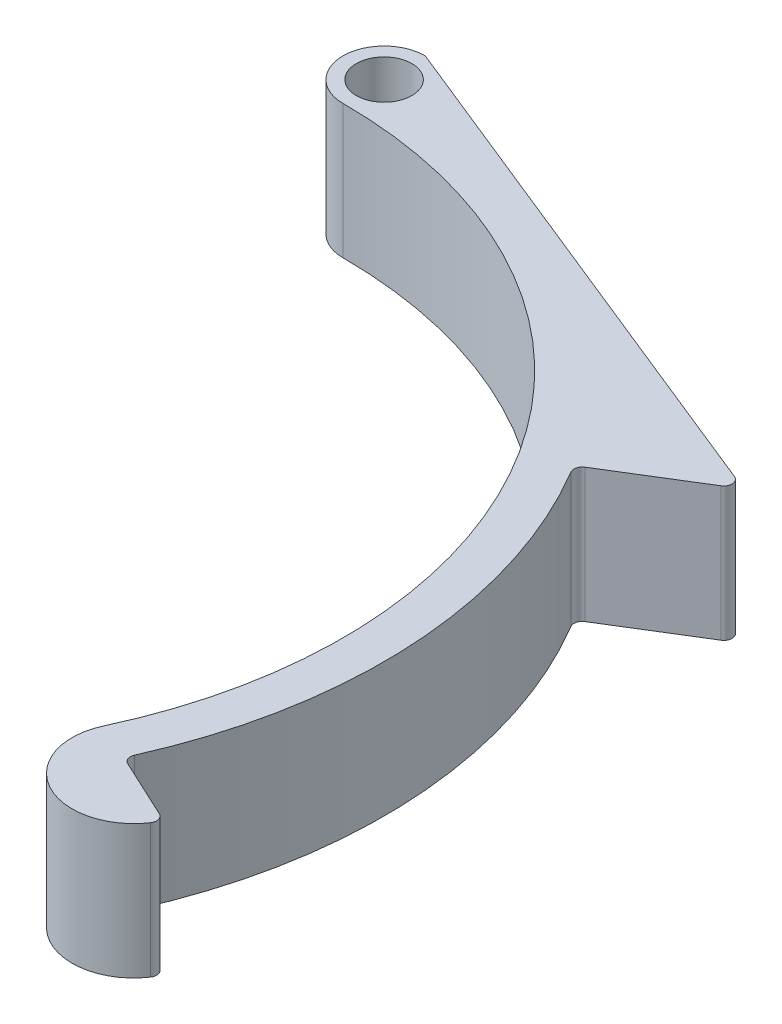
ISO-10303-21;
HEADER;
FILE_DESCRIPTION(('STEP AP214'),'2;1');
FILE_NAME('part.step','',(''),(''),'','','');
FILE_SCHEMA(('AUTOMOTIVE_DESIGN { 1 0 10303 214 1 1 1 1 }'));
ENDSEC;
DATA;
#1=APPLICATION_CONTEXT('core data for automotive mechanical design processes');
#2=APPLICATION_PROTOCOL_DEFINITION('international standard','automotive_design',2000,#1);
#3=PRODUCT_CONTEXT('',#1,'mechanical');
#4=PRODUCT('Part','Part','',(#3));
#5=PRODUCT_RELATED_PRODUCT_CATEGORY('part','',(#4));
#6=PRODUCT_DEFINITION_FORMATION('','',#4);
#7=PRODUCT_DEFINITION_CONTEXT('part definition',#1,'design');
#8=PRODUCT_DEFINITION('design','',#6,#7);
#9=PRODUCT_DEFINITION_SHAPE('','',#8);
#10=(LENGTH_UNIT() NAMED_UNIT(*) SI_UNIT(.MILLI.,.METRE.));
#11=(NAMED_UNIT(*) PLANE_ANGLE_UNIT() SI_UNIT($,.RADIAN.));
#12=(NAMED_UNIT(*) SI_UNIT($,.STERADIAN.) SOLID_ANGLE_UNIT());
#13=UNCERTAINTY_MEASURE_WITH_UNIT(LENGTH_MEASURE(1.E-05),#10,'distance_accuracy_value','');
#14=(GEOMETRIC_REPRESENTATION_CONTEXT(3) GLOBAL_UNCERTAINTY_ASSIGNED_CONTEXT((#13)) GLOBAL_UNIT_ASSIGNED_CONTEXT((#10,
#11,#12)) REPRESENTATION_CONTEXT('',''));
#15=CARTESIAN_POINT('',(0.,0.,0.));
#16=DIRECTION('',(0.,0.,1.));
#17=DIRECTION('',(1.,0.,0.));
#18=AXIS2_PLACEMENT_3D('',#15,#16,#17);
#19=CARTESIAN_POINT('',(0.,13.,0.));
#20=DIRECTION('',(0.,-1.,0.));
#21=DIRECTION('',(0.,0.,-1.));
#22=AXIS2_PLACEMENT_3D('',#19,#20,#21);
#23=CYLINDRICAL_SURFACE('',#22,45.);
#24=CARTESIAN_POINT('',(0.,0.,0.));
#25=DIRECTION('',(0.,1.,0.));
#26=DIRECTION('',(0.,0.,1.));
#27=AXIS2_PLACEMENT_3D('',#24,#25,#26);
#28=CIRCLE('',#27,45.);
#29=CARTESIAN_POINT('',(0.,0.,-45.));
#30=VERTEX_POINT('',#29);
#31=CARTESIAN_POINT('',(40.7838504166493,0.,19.0178217783314));
#32=VERTEX_POINT('',#31);
#33=EDGE_CURVE('E158',#30,#32,#28,.F.);
#34=ORIENTED_EDGE('',*,*,#33,.T.);
#35=DIRECTION('',(0.,-1.,0.));
#36=VECTOR('',#35,1.);
#37=CARTESIAN_POINT('',(40.7838504166493,13.,19.0178217783314));
#38=LINE('',#37,#36);
#39=CARTESIAN_POINT('',(40.7838504166493,13.,19.0178217783314));
#40=VERTEX_POINT('',#39);
#41=EDGE_CURVE('E141',#40,#32,#38,.T.);
#42=ORIENTED_EDGE('',*,*,#41,.F.);
#43=CARTESIAN_POINT('',(0.,13.,0.));
#44=DIRECTION('',(0.,1.,0.));
#45=DIRECTION('',(0.,0.,1.));
#46=AXIS2_PLACEMENT_3D('',#43,#44,#45);
#47=CIRCLE('',#46,45.);
#48=CARTESIAN_POINT('',(0.,13.,-45.));
#49=VERTEX_POINT('',#48);
#50=EDGE_CURVE('E148',#49,#40,#47,.F.);
#51=ORIENTED_EDGE('',*,*,#50,.F.);
#52=DIRECTION('',(0.,-1.,0.));
#53=VECTOR('',#52,1.);
#54=CARTESIAN_POINT('',(0.,13.,-45.));
#55=LINE('',#54,#53);
#56=EDGE_CURVE('E161',#49,#30,#55,.T.);
#57=ORIENTED_EDGE('',*,*,#56,.T.);
#58=EDGE_LOOP('',(#34,#42,#51,#57));
#59=FACE_BOUND('',#58,.T.);
#60=ADVANCED_FACE('F45',(#59),#23,.F.);
#61=CARTESIAN_POINT('',(46.2216971388692,13.,21.5535313487756));
#62=DIRECTION('',(0.,-1.,0.));
#63=DIRECTION('',(0.,0.,-1.));
#64=AXIS2_PLACEMENT_3D('',#61,#62,#63);
#65=CYLINDRICAL_SURFACE('',#64,6.);
#66=CARTESIAN_POINT('',(46.2216971388692,0.,21.5535313487756));
#67=DIRECTION('',(0.,1.,0.));
#68=DIRECTION('',(0.,0.,1.));
#69=AXIS2_PLACEMENT_3D('',#66,#67,#68);
#70=CIRCLE('',#69,6.);
#71=CARTESIAN_POINT('',(51.2046961183429,0.,24.8956446279096));
#72=VERTEX_POINT('',#71);
#73=EDGE_CURVE('E266',#32,#72,#70,.T.);
#74=ORIENTED_EDGE('',*,*,#73,.T.);
#75=DIRECTION('',(0.,-1.,0.));
#76=VECTOR('',#75,1.);
#77=CARTESIAN_POINT('',(51.2046961183429,13.,24.8956446279096));
#78=LINE('',#77,#76);
#79=CARTESIAN_POINT('',(51.2046961183429,13.,24.8956446279096));
#80=VERTEX_POINT('',#79);
#81=EDGE_CURVE('E144',#72,#80,#78,.F.);
#82=ORIENTED_EDGE('',*,*,#81,.T.);
#83=CARTESIAN_POINT('',(46.2216971388692,13.,21.5535313487756));
#84=DIRECTION('',(0.,1.,0.));
#85=DIRECTION('',(0.,0.,1.));
#86=AXIS2_PLACEMENT_3D('',#83,#84,#85);
#87=CIRCLE('',#86,6.);
#88=EDGE_CURVE('E136',#40,#80,#87,.T.);
#89=ORIENTED_EDGE('',*,*,#88,.F.);
#90=ORIENTED_EDGE('',*,*,#41,.T.);
#91=EDGE_LOOP('',(#74,#82,#89,#90));
#92=FACE_BOUND('',#91,.T.);
#93=ADVANCED_FACE('F139',(#92),#65,.T.);
#94=CARTESIAN_POINT('',(0.,13.,0.));
#95=DIRECTION('',(-0.422618261740697,0.,0.906307787036651));
#96=DIRECTION('',(0.906307787036651,0.,0.422618261740697));
#97=AXIS2_PLACEMENT_3D('',#94,#95,#96);
#98=PLANE('',#97);
#99=DIRECTION('',(-0.906307787036651,0.,-0.422618261740697));
#100=VECTOR('',#99,1.);
#101=CARTESIAN_POINT('',(0.,13.,0.));
#102=LINE('',#101,#100);
#103=CARTESIAN_POINT('',(50.8783908638056,13.,23.7249832943957));
#104=VERTEX_POINT('',#103);
#105=CARTESIAN_POINT('',(45.1283037541675,13.,21.0436736401131));
#106=VERTEX_POINT('',#105);
#107=EDGE_CURVE('E147',#104,#106,#102,.T.);
#108=ORIENTED_EDGE('',*,*,#107,.F.);
#109=DIRECTION('',(0.,-1.,0.));
#110=VECTOR('',#109,1.);
#111=CARTESIAN_POINT('',(50.8783908638056,13.,23.7249832943957));
#112=LINE('',#111,#110);
#113=CARTESIAN_POINT('',(50.8783908638056,0.,23.7249832943957));
#114=VERTEX_POINT('',#113);
#115=EDGE_CURVE('E165',#104,#114,#112,.T.);
#116=ORIENTED_EDGE('',*,*,#115,.T.);
#117=DIRECTION('',(-0.906307787036651,0.,-0.422618261740697));
#118=VECTOR('',#117,1.);
#119=CARTESIAN_POINT('',(0.,0.,0.));
#120=LINE('',#119,#118);
#121=CARTESIAN_POINT('',(45.1283037541675,0.,21.0436736401131));
#122=VERTEX_POINT('',#121);
#123=EDGE_CURVE('E240',#114,#122,#120,.T.);
#124=ORIENTED_EDGE('',*,*,#123,.T.);
#125=DIRECTION('',(0.,1.,0.));
#126=VECTOR('',#125,1.);
#127=CARTESIAN_POINT('',(45.1283037541675,13.,21.0436736401131));
#128=LINE('',#127,#126);
#129=EDGE_CURVE('E160',#122,#106,#128,.T.);
#130=ORIENTED_EDGE('',*,*,#129,.T.);
#131=EDGE_LOOP('',(#108,#116,#124,#130));
#132=FACE_BOUND('',#131,.T.);
#133=ADVANCED_FACE('F295',(#132),#98,.F.);
#134=CARTESIAN_POINT('',(0.,13.,0.));
#135=DIRECTION('',(0.,-1.,0.));
#136=DIRECTION('',(0.,0.,-1.));
#137=AXIS2_PLACEMENT_3D('',#134,#135,#136);
#138=CYLINDRICAL_SURFACE('',#137,49.);
#139=CARTESIAN_POINT('',(0.,13.,0.));
#140=DIRECTION('',(0.,1.,0.));
#141=DIRECTION('',(0.,0.,1.));
#142=AXIS2_PLACEMENT_3D('',#139,#140,#141);
#143=CIRCLE('',#142,49.);
#144=CARTESIAN_POINT('',(44.7360144541053,13.,19.9922237573033));
#145=VERTEX_POINT('',#144);
#146=CARTESIAN_POINT('',(42.1148392112088,13.,-25.0467626294103));
#147=VERTEX_POINT('',#146);
#148=EDGE_CURVE('E245',#145,#147,#143,.T.);
#149=ORIENTED_EDGE('',*,*,#148,.F.);
#150=DIRECTION('',(0.,-1.,0.));
#151=VECTOR('',#150,1.);
#152=CARTESIAN_POINT('',(44.7360144541052,13.,19.9922237573033));
#153=LINE('',#152,#151);
#154=CARTESIAN_POINT('',(44.7360144541053,0.,19.9922237573033));
#155=VERTEX_POINT('',#154);
#156=EDGE_CURVE('E194',#145,#155,#153,.T.);
#157=ORIENTED_EDGE('',*,*,#156,.T.);
#158=CARTESIAN_POINT('',(0.,0.,0.));
#159=DIRECTION('',(0.,1.,0.));
#160=DIRECTION('',(0.,0.,1.));
#161=AXIS2_PLACEMENT_3D('',#158,#159,#160);
#162=CIRCLE('',#161,49.);
#163=CARTESIAN_POINT('',(42.1148392112088,0.,-25.0467626294103));
#164=VERTEX_POINT('',#163);
#165=EDGE_CURVE('E228',#155,#164,#162,.T.);
#166=ORIENTED_EDGE('',*,*,#165,.T.);
#167=DIRECTION('',(0.,-1.,0.));
#168=VECTOR('',#167,1.);
#169=CARTESIAN_POINT('',(42.1148392112088,13.,-25.0467626294103));
#170=LINE('',#169,#168);
#171=EDGE_CURVE('E191',#164,#147,#170,.F.);
#172=ORIENTED_EDGE('',*,*,#171,.T.);
#173=EDGE_LOOP('',(#149,#157,#166,#172));
#174=FACE_BOUND('',#173,.T.);
#175=ADVANCED_FACE('F236',(#174),#138,.T.);
#176=CARTESIAN_POINT('',(0.,13.,0.));
#177=DIRECTION('',(0.524899474172595,0.,0.851164227404637));
#178=DIRECTION('',(0.851164227404637,0.,-0.524899474172595));
#179=AXIS2_PLACEMENT_3D('',#176,#177,#178);
#180=PLANE('',#179);
#181=DIRECTION('',(-0.851164227404637,0.,0.524899474172595));
#182=VECTOR('',#181,1.);
#183=CARTESIAN_POINT('',(0.,0.,0.));
#184=LINE('',#183,#182);
#185=CARTESIAN_POINT('',(50.5748997151719,0.,-31.1887382153871));
#186=VERTEX_POINT('',#185);
#187=CARTESIAN_POINT('',(42.3825088434823,0.,-26.1366207481407));
#188=VERTEX_POINT('',#187);
#189=EDGE_CURVE('E230',#186,#188,#184,.T.);
#190=ORIENTED_EDGE('',*,*,#189,.F.);
#191=DIRECTION('',(0.,-1.,0.));
#192=VECTOR('',#191,1.);
#193=CARTESIAN_POINT('',(50.5748997151719,13.,-31.1887382153871));
#194=LINE('',#193,#192);
#195=CARTESIAN_POINT('',(50.5748997151719,13.,-31.1887382153871));
#196=VERTEX_POINT('',#195);
#197=EDGE_CURVE('E213',#186,#196,#194,.F.);
#198=ORIENTED_EDGE('',*,*,#197,.T.);
#199=DIRECTION('',(-0.851164227404637,0.,0.524899474172595));
#200=VECTOR('',#199,1.);
#201=CARTESIAN_POINT('',(0.,13.,0.));
#202=LINE('',#201,#200);
#203=CARTESIAN_POINT('',(42.3825088434823,13.,-26.1366207481407));
#204=VERTEX_POINT('',#203);
#205=EDGE_CURVE('E244',#196,#204,#202,.T.);
#206=ORIENTED_EDGE('',*,*,#205,.T.);
#207=DIRECTION('',(0.,-1.,0.));
#208=VECTOR('',#207,1.);
#209=CARTESIAN_POINT('',(42.3825088434823,13.,-26.1366207481407));
#210=LINE('',#209,#208);
#211=EDGE_CURVE('E209',#204,#188,#210,.T.);
#212=ORIENTED_EDGE('',*,*,#211,.T.);
#213=EDGE_LOOP('',(#190,#198,#206,#212));
#214=FACE_BOUND('',#213,.T.);
#215=ADVANCED_FACE('F247',(#214),#180,.T.);
#216=CARTESIAN_POINT('',(18.4107690922549,13.,-45.5602618405853));
#217=DIRECTION('',(0.374663072776281,0.,-0.927161033422908));
#218=DIRECTION('',(-0.927161033422908,0.,-0.374663072776281));
#219=AXIS2_PLACEMENT_3D('',#216,#217,#218);
#220=PLANE('',#219);
#221=DIRECTION('',(0.927161033422908,0.,0.374663072776281));
#222=VECTOR('',#221,1.);
#223=CARTESIAN_POINT('',(18.4107690922549,0.,-45.5602618405853));
#224=LINE('',#223,#222);
#225=CARTESIAN_POINT('',(0.152578115339287,0.,-52.938343628053));
#226=VERTEX_POINT('',#225);
#227=CARTESIAN_POINT('',(50.4547105940548,0.,-32.6113984240491));
#228=VERTEX_POINT('',#227);
#229=EDGE_CURVE('E274',#226,#228,#224,.T.);
#230=ORIENTED_EDGE('',*,*,#229,.F.);
#231=DIRECTION('',(0.,-1.,0.));
#232=VECTOR('',#231,1.);
#233=CARTESIAN_POINT('',(0.152578115339284,13.,-52.938343628053));
#234=LINE('',#233,#232);
#235=CARTESIAN_POINT('',(0.152578115339287,13.,-52.938343628053));
#236=VERTEX_POINT('',#235);
#237=EDGE_CURVE('E206',#226,#236,#234,.F.);
#238=ORIENTED_EDGE('',*,*,#237,.T.);
#239=DIRECTION('',(0.927161033422908,0.,0.374663072776281));
#240=VECTOR('',#239,1.);
#241=CARTESIAN_POINT('',(18.4107690922549,13.,-45.5602618405853));
#242=LINE('',#241,#240);
#243=CARTESIAN_POINT('',(50.4547105940548,13.,-32.6113984240491));
#244=VERTEX_POINT('',#243);
#245=EDGE_CURVE('E250',#236,#244,#242,.T.);
#246=ORIENTED_EDGE('',*,*,#245,.T.);
#247=DIRECTION('',(0.,-1.,0.));
#248=VECTOR('',#247,1.);
#249=CARTESIAN_POINT('',(50.4547105940548,13.,-32.6113984240491));
#250=LINE('',#249,#248);
#251=EDGE_CURVE('E202',#244,#228,#250,.T.);
#252=ORIENTED_EDGE('',*,*,#251,.T.);
#253=EDGE_LOOP('',(#230,#238,#246,#252));
#254=FACE_BOUND('',#253,.T.);
#255=ADVANCED_FACE('F306',(#254),#220,.T.);
#256=CARTESIAN_POINT('',(0.,13.,-49.));
#257=DIRECTION('',(0.,-1.,0.));
#258=DIRECTION('',(0.,0.,-1.));
#259=AXIS2_PLACEMENT_3D('',#256,#257,#258);
#260=CYLINDRICAL_SURFACE('',#259,2.7);
#261=CARTESIAN_POINT('',(0.,13.,-49.));
#262=DIRECTION('',(0.,1.,0.));
#263=DIRECTION('',(0.,0.,1.));
#264=AXIS2_PLACEMENT_3D('',#261,#262,#263);
#265=CIRCLE('',#264,2.7);
#266=CARTESIAN_POINT('',(0.,13.,-46.3));
#267=VERTEX_POINT('',#266);
#268=EDGE_CURVE('E155',#267,#267,#265,.T.);
#269=ORIENTED_EDGE('',*,*,#268,.T.);
#270=EDGE_LOOP('',(#269));
#271=FACE_BOUND('',#270,.T.);
#272=CARTESIAN_POINT('',(0.,0.,-49.));
#273=DIRECTION('',(0.,1.,0.));
#274=DIRECTION('',(0.,0.,1.));
#275=AXIS2_PLACEMENT_3D('',#272,#273,#274);
#276=CIRCLE('',#275,2.7);
#277=CARTESIAN_POINT('',(0.,0.,-46.3));
#278=VERTEX_POINT('',#277);
#279=EDGE_CURVE('E260',#278,#278,#276,.T.);
#280=ORIENTED_EDGE('',*,*,#279,.F.);
#281=EDGE_LOOP('',(#280));
#282=FACE_BOUND('',#281,.T.);
#283=ADVANCED_FACE('F324',(#271,#282),#260,.F.);
#284=CARTESIAN_POINT('',(0.,13.,-49.));
#285=DIRECTION('',(0.,-1.,0.));
#286=DIRECTION('',(0.,0.,-1.));
#287=AXIS2_PLACEMENT_3D('',#284,#285,#286);
#288=CYLINDRICAL_SURFACE('',#287,4.);
#289=CARTESIAN_POINT('',(0.,13.,-49.));
#290=DIRECTION('',(0.,1.,0.));
#291=DIRECTION('',(0.,0.,1.));
#292=AXIS2_PLACEMENT_3D('',#289,#290,#291);
#293=CIRCLE('',#292,4.);
#294=CARTESIAN_POINT('',(-0.183940428602176,13.,-52.9957685016434));
#295=VERTEX_POINT('',#294);
#296=EDGE_CURVE('E152',#49,#295,#293,.F.);
#297=ORIENTED_EDGE('',*,*,#296,.T.);
#298=DIRECTION('',(0.,-1.,0.));
#299=VECTOR('',#298,1.);
#300=CARTESIAN_POINT('',(-0.183940428602176,13.,-52.9957685016434));
#301=LINE('',#300,#299);
#302=CARTESIAN_POINT('',(-0.183940428602176,0.,-52.9957685016434));
#303=VERTEX_POINT('',#302);
#304=EDGE_CURVE('E198',#295,#303,#301,.T.);
#305=ORIENTED_EDGE('',*,*,#304,.T.);
#306=CARTESIAN_POINT('',(0.,0.,-49.));
#307=DIRECTION('',(0.,1.,0.));
#308=DIRECTION('',(0.,0.,1.));
#309=AXIS2_PLACEMENT_3D('',#306,#307,#308);
#310=CIRCLE('',#309,4.);
#311=EDGE_CURVE('E277',#30,#303,#310,.F.);
#312=ORIENTED_EDGE('',*,*,#311,.F.);
#313=ORIENTED_EDGE('',*,*,#56,.F.);
#314=EDGE_LOOP('',(#297,#305,#312,#313));
#315=FACE_BOUND('',#314,.T.);
#316=ADVANCED_FACE('F299',(#315),#288,.T.);
#317=CARTESIAN_POINT('',(0.,13.,0.));
#318=DIRECTION('',(0.,1.,0.));
#319=DIRECTION('',(0.,0.,1.));
#320=AXIS2_PLACEMENT_3D('',#317,#318,#319);
#321=PLANE('',#320);
#322=ORIENTED_EDGE('',*,*,#268,.F.);
#323=EDGE_LOOP('',(#322));
#324=FACE_BOUND('',#323,.T.);
#325=ORIENTED_EDGE('',*,*,#88,.T.);
#326=CARTESIAN_POINT('',(50.5402962544131,13.,24.450029524025));
#327=DIRECTION('',(0.,1.,0.));
#328=DIRECTION('',(0.,0.,1.));
#329=AXIS2_PLACEMENT_3D('',#326,#327,#328);
#330=CIRCLE('',#329,0.8);
#331=EDGE_CURVE('E188',#80,#104,#330,.T.);
#332=ORIENTED_EDGE('',*,*,#331,.T.);
#333=ORIENTED_EDGE('',*,*,#107,.T.);
#334=CARTESIAN_POINT('',(45.46639836356,13.,20.3186274104838));
#335=DIRECTION('',(0.,1.,0.));
#336=DIRECTION('',(0.,0.,1.));
#337=AXIS2_PLACEMENT_3D('',#334,#335,#336);
#338=CIRCLE('',#337,0.8);
#339=EDGE_CURVE('E219',#106,#145,#338,.F.);
#340=ORIENTED_EDGE('',*,*,#339,.T.);
#341=ORIENTED_EDGE('',*,*,#148,.T.);
#342=CARTESIAN_POINT('',(42.8024284228204,13.,-25.455689366217));
#343=DIRECTION('',(0.,1.,0.));
#344=DIRECTION('',(0.,0.,1.));
#345=AXIS2_PLACEMENT_3D('',#342,#343,#344);
#346=CIRCLE('',#345,0.8);
#347=EDGE_CURVE('E11',#147,#204,#346,.F.);
#348=ORIENTED_EDGE('',*,*,#347,.T.);
#349=ORIENTED_EDGE('',*,*,#205,.F.);
#350=CARTESIAN_POINT('',(50.1549801358338,13.,-31.8696695973108));
#351=DIRECTION('',(0.,1.,0.));
#352=DIRECTION('',(0.,0.,1.));
#353=AXIS2_PLACEMENT_3D('',#350,#351,#352);
#354=CIRCLE('',#353,0.8);
#355=EDGE_CURVE('E67',#196,#244,#354,.T.);
#356=ORIENTED_EDGE('',*,*,#355,.T.);
#357=ORIENTED_EDGE('',*,*,#245,.F.);
#358=CARTESIAN_POINT('',(-0.147152342881741,13.,-52.1966148013147));
#359=DIRECTION('',(0.,1.,0.));
#360=DIRECTION('',(0.,0.,1.));
#361=AXIS2_PLACEMENT_3D('',#358,#359,#360);
#362=CIRCLE('',#361,0.8);
#363=EDGE_CURVE('E61',#236,#295,#362,.T.);
#364=ORIENTED_EDGE('',*,*,#363,.T.);
#365=ORIENTED_EDGE('',*,*,#296,.F.);
#366=ORIENTED_EDGE('',*,*,#50,.T.);
#367=EDGE_LOOP('',(#325,#332,#333,#340,#341,#348,#349,#356,#357,#364,#365,#366));
#368=FACE_BOUND('',#367,.T.);
#369=ADVANCED_FACE('F151',(#324,#368),#321,.T.);
#370=CARTESIAN_POINT('',(0.,0.,0.));
#371=DIRECTION('',(0.,1.,0.));
#372=DIRECTION('',(0.,0.,1.));
#373=AXIS2_PLACEMENT_3D('',#370,#371,#372);
#374=PLANE('',#373);
#375=ORIENTED_EDGE('',*,*,#279,.T.);
#376=EDGE_LOOP('',(#375));
#377=FACE_BOUND('',#376,.T.);
#378=ORIENTED_EDGE('',*,*,#123,.F.);
#379=CARTESIAN_POINT('',(50.5402962544131,0.,24.450029524025));
#380=DIRECTION('',(0.,1.,0.));
#381=DIRECTION('',(0.,0.,1.));
#382=AXIS2_PLACEMENT_3D('',#379,#380,#381);
#383=CIRCLE('',#382,0.8);
#384=EDGE_CURVE('E179',#114,#72,#383,.F.);
#385=ORIENTED_EDGE('',*,*,#384,.T.);
#386=ORIENTED_EDGE('',*,*,#73,.F.);
#387=ORIENTED_EDGE('',*,*,#33,.F.);
#388=ORIENTED_EDGE('',*,*,#311,.T.);
#389=CARTESIAN_POINT('',(-0.147152342881741,0.,-52.1966148013147));
#390=DIRECTION('',(0.,1.,0.));
#391=DIRECTION('',(0.,0.,1.));
#392=AXIS2_PLACEMENT_3D('',#389,#390,#391);
#393=CIRCLE('',#392,0.8);
#394=EDGE_CURVE('E176',#303,#226,#393,.F.);
#395=ORIENTED_EDGE('',*,*,#394,.T.);
#396=ORIENTED_EDGE('',*,*,#229,.T.);
#397=CARTESIAN_POINT('',(50.1549801358338,0.,-31.8696695973108));
#398=DIRECTION('',(0.,1.,0.));
#399=DIRECTION('',(0.,0.,1.));
#400=AXIS2_PLACEMENT_3D('',#397,#398,#399);
#401=CIRCLE('',#400,0.8);
#402=EDGE_CURVE('E173',#228,#186,#401,.F.);
#403=ORIENTED_EDGE('',*,*,#402,.T.);
#404=ORIENTED_EDGE('',*,*,#189,.T.);
#405=CARTESIAN_POINT('',(42.8024284228204,0.,-25.455689366217));
#406=DIRECTION('',(0.,1.,0.));
#407=DIRECTION('',(0.,0.,1.));
#408=AXIS2_PLACEMENT_3D('',#405,#406,#407);
#409=CIRCLE('',#408,0.8);
#410=EDGE_CURVE('E54',#188,#164,#409,.T.);
#411=ORIENTED_EDGE('',*,*,#410,.T.);
#412=ORIENTED_EDGE('',*,*,#165,.F.);
#413=CARTESIAN_POINT('',(45.46639836356,0.,20.3186274104838));
#414=DIRECTION('',(0.,1.,0.));
#415=DIRECTION('',(0.,0.,1.));
#416=AXIS2_PLACEMENT_3D('',#413,#414,#415);
#417=CIRCLE('',#416,0.8);
#418=EDGE_CURVE('E216',#155,#122,#417,.T.);
#419=ORIENTED_EDGE('',*,*,#418,.T.);
#420=EDGE_LOOP('',(#378,#385,#386,#387,#388,#395,#396,#403,#404,#411,#412,#419));
#421=FACE_BOUND('',#420,.T.);
#422=ADVANCED_FACE('F227',(#377,#421),#374,.F.);
#423=CARTESIAN_POINT('',(50.5402962544131,13.,24.450029524025));
#424=DIRECTION('',(0.,-1.,0.));
#425=DIRECTION('',(0.,0.,-1.));
#426=AXIS2_PLACEMENT_3D('',#423,#424,#425);
#427=CYLINDRICAL_SURFACE('',#426,0.8);
#428=ORIENTED_EDGE('',*,*,#331,.F.);
#429=ORIENTED_EDGE('',*,*,#81,.F.);
#430=ORIENTED_EDGE('',*,*,#384,.F.);
#431=ORIENTED_EDGE('',*,*,#115,.F.);
#432=EDGE_LOOP('',(#428,#429,#430,#431));
#433=FACE_BOUND('',#432,.T.);
#434=ADVANCED_FACE('F297',(#433),#427,.T.);
#435=CARTESIAN_POINT('',(45.46639836356,13.,20.3186274104838));
#436=DIRECTION('',(0.,-1.,0.));
#437=DIRECTION('',(0.,0.,-1.));
#438=AXIS2_PLACEMENT_3D('',#435,#436,#437);
#439=CYLINDRICAL_SURFACE('',#438,0.8);
#440=ORIENTED_EDGE('',*,*,#339,.F.);
#441=ORIENTED_EDGE('',*,*,#129,.F.);
#442=ORIENTED_EDGE('',*,*,#418,.F.);
#443=ORIENTED_EDGE('',*,*,#156,.F.);
#444=EDGE_LOOP('',(#440,#441,#442,#443));
#445=FACE_BOUND('',#444,.T.);
#446=ADVANCED_FACE('F294',(#445),#439,.F.);
#447=CARTESIAN_POINT('',(-0.147152342881741,13.,-52.1966148013147));
#448=DIRECTION('',(0.,-1.,0.));
#449=DIRECTION('',(0.,0.,-1.));
#450=AXIS2_PLACEMENT_3D('',#447,#448,#449);
#451=CYLINDRICAL_SURFACE('',#450,0.8);
#452=ORIENTED_EDGE('',*,*,#363,.F.);
#453=ORIENTED_EDGE('',*,*,#237,.F.);
#454=ORIENTED_EDGE('',*,*,#394,.F.);
#455=ORIENTED_EDGE('',*,*,#304,.F.);
#456=EDGE_LOOP('',(#452,#453,#454,#455));
#457=FACE_BOUND('',#456,.T.);
#458=ADVANCED_FACE('F302',(#457),#451,.T.);
#459=CARTESIAN_POINT('',(50.1549801358338,13.,-31.8696695973108));
#460=DIRECTION('',(0.,-1.,0.));
#461=DIRECTION('',(0.,0.,-1.));
#462=AXIS2_PLACEMENT_3D('',#459,#460,#461);
#463=CYLINDRICAL_SURFACE('',#462,0.8);
#464=ORIENTED_EDGE('',*,*,#355,.F.);
#465=ORIENTED_EDGE('',*,*,#197,.F.);
#466=ORIENTED_EDGE('',*,*,#402,.F.);
#467=ORIENTED_EDGE('',*,*,#251,.F.);
#468=EDGE_LOOP('',(#464,#465,#466,#467));
#469=FACE_BOUND('',#468,.T.);
#470=ADVANCED_FACE('F309',(#469),#463,.T.);
#471=CARTESIAN_POINT('',(42.8024284228204,13.,-25.455689366217));
#472=DIRECTION('',(0.,-1.,0.));
#473=DIRECTION('',(0.,0.,-1.));
#474=AXIS2_PLACEMENT_3D('',#471,#472,#473);
#475=CYLINDRICAL_SURFACE('',#474,0.8);
#476=ORIENTED_EDGE('',*,*,#347,.F.);
#477=ORIENTED_EDGE('',*,*,#171,.F.);
#478=ORIENTED_EDGE('',*,*,#410,.F.);
#479=ORIENTED_EDGE('',*,*,#211,.F.);
#480=EDGE_LOOP('',(#476,#477,#478,#479));
#481=FACE_BOUND('',#480,.T.);
#482=ADVANCED_FACE('F47',(#481),#475,.F.);
#483=CLOSED_SHELL('',(#60,#93,#133,#175,#215,#255,#283,#316,#369,#422,#434,#446,#458,#470,#482));
#484=MANIFOLD_SOLID_BREP('B2',#483);
#485=ADVANCED_BREP_SHAPE_REPRESENTATION('',(#18,#484),#14);
#486=SHAPE_DEFINITION_REPRESENTATION(#9,#485);
ENDSEC;
END-ISO-10303-21;
